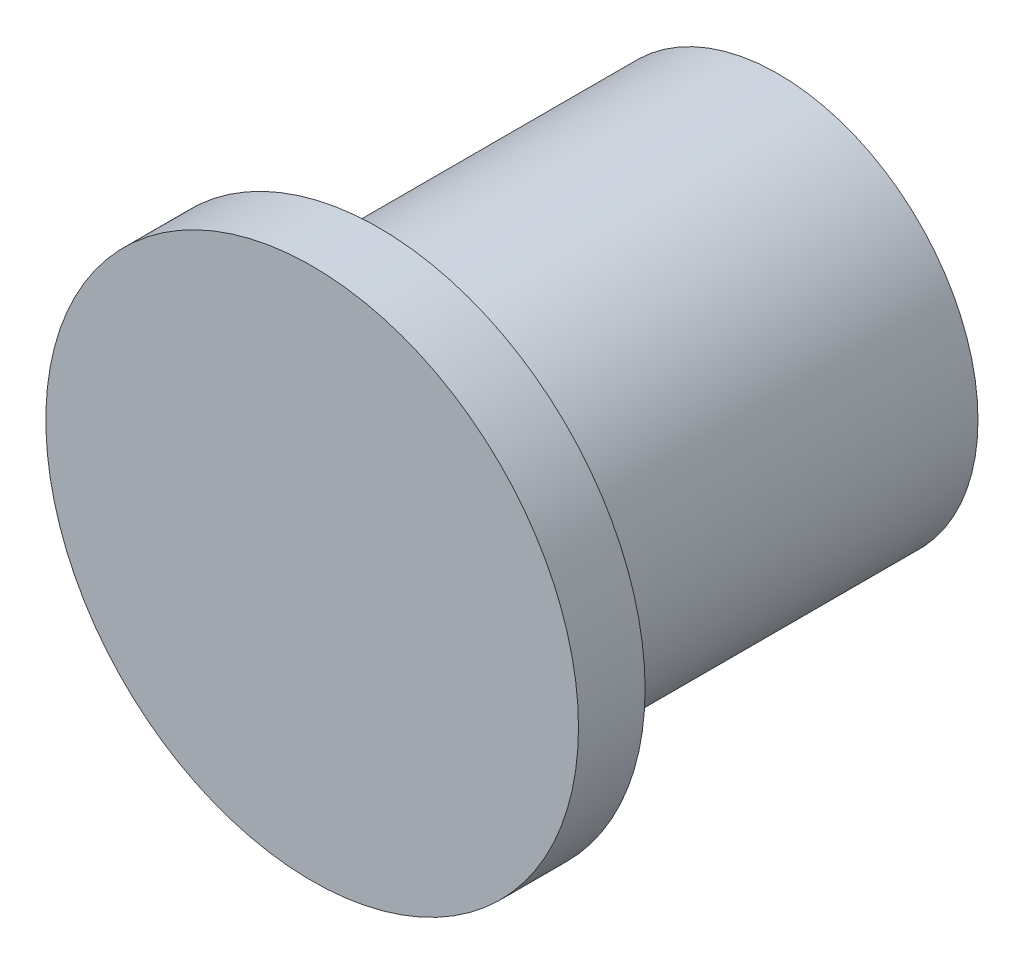
ISO-10303-21;
HEADER;
FILE_DESCRIPTION(('STEP AP214'),'2;1');
FILE_NAME('part.step','',(''),(''),'','','');
FILE_SCHEMA(('AUTOMOTIVE_DESIGN { 1 0 10303 214 1 1 1 1 }'));
ENDSEC;
DATA;
#1=APPLICATION_CONTEXT('core data for automotive mechanical design processes');
#2=APPLICATION_PROTOCOL_DEFINITION('international standard','automotive_design',2000,#1);
#3=PRODUCT_CONTEXT('',#1,'mechanical');
#4=PRODUCT('Part','Part','',(#3));
#5=PRODUCT_RELATED_PRODUCT_CATEGORY('part','',(#4));
#6=PRODUCT_DEFINITION_FORMATION('','',#4);
#7=PRODUCT_DEFINITION_CONTEXT('part definition',#1,'design');
#8=PRODUCT_DEFINITION('design','',#6,#7);
#9=PRODUCT_DEFINITION_SHAPE('','',#8);
#10=(LENGTH_UNIT() NAMED_UNIT(*) SI_UNIT(.MILLI.,.METRE.));
#11=(NAMED_UNIT(*) PLANE_ANGLE_UNIT() SI_UNIT($,.RADIAN.));
#12=(NAMED_UNIT(*) SI_UNIT($,.STERADIAN.) SOLID_ANGLE_UNIT());
#13=UNCERTAINTY_MEASURE_WITH_UNIT(LENGTH_MEASURE(1.E-05),#10,'distance_accuracy_value','');
#14=(GEOMETRIC_REPRESENTATION_CONTEXT(3) GLOBAL_UNCERTAINTY_ASSIGNED_CONTEXT((#13)) GLOBAL_UNIT_ASSIGNED_CONTEXT((#10,
#11,#12)) REPRESENTATION_CONTEXT('',''));
#15=CARTESIAN_POINT('',(0.,0.,0.));
#16=DIRECTION('',(0.,0.,1.));
#17=DIRECTION('',(1.,0.,0.));
#18=AXIS2_PLACEMENT_3D('',#15,#16,#17);
#19=CARTESIAN_POINT('',(0.,0.,152.4));
#20=DIRECTION('',(0.,0.,-1.));
#21=DIRECTION('',(-1.,0.,0.));
#22=AXIS2_PLACEMENT_3D('',#19,#20,#21);
#23=CYLINDRICAL_SURFACE('',#22,76.2);
#24=CARTESIAN_POINT('',(0.,0.,152.4));
#25=DIRECTION('',(0.,0.,1.));
#26=DIRECTION('',(1.,0.,0.));
#27=AXIS2_PLACEMENT_3D('',#24,#25,#26);
#28=CIRCLE('',#27,76.2);
#29=CARTESIAN_POINT('',(76.2,0.,152.4));
#30=VERTEX_POINT('',#29);
#31=EDGE_CURVE('E10',#30,#30,#28,.T.);
#32=ORIENTED_EDGE('',*,*,#31,.F.);
#33=EDGE_LOOP('',(#32));
#34=FACE_BOUND('',#33,.T.);
#35=CARTESIAN_POINT('',(0.,0.,0.));
#36=DIRECTION('',(0.,0.,1.));
#37=DIRECTION('',(1.,0.,0.));
#38=AXIS2_PLACEMENT_3D('',#35,#36,#37);
#39=CIRCLE('',#38,76.2);
#40=CARTESIAN_POINT('',(76.2,0.,0.));
#41=VERTEX_POINT('',#40);
#42=EDGE_CURVE('E44',#41,#41,#39,.T.);
#43=ORIENTED_EDGE('',*,*,#42,.T.);
#44=EDGE_LOOP('',(#43));
#45=FACE_BOUND('',#44,.T.);
#46=ADVANCED_FACE('F41',(#34,#45),#23,.T.);
#47=CARTESIAN_POINT('',(0.,0.,0.));
#48=DIRECTION('',(0.,0.,1.));
#49=DIRECTION('',(1.,0.,0.));
#50=AXIS2_PLACEMENT_3D('',#47,#48,#49);
#51=PLANE('',#50);
#52=ORIENTED_EDGE('',*,*,#42,.F.);
#53=EDGE_LOOP('',(#52));
#54=FACE_BOUND('',#53,.T.);
#55=ADVANCED_FACE('F68',(#54),#51,.F.);
#56=CARTESIAN_POINT('',(0.,0.,177.8));
#57=DIRECTION('',(0.,0.,-1.));
#58=DIRECTION('',(-1.,0.,0.));
#59=AXIS2_PLACEMENT_3D('',#56,#57,#58);
#60=CYLINDRICAL_SURFACE('',#59,101.6);
#61=CARTESIAN_POINT('',(0.,0.,177.8));
#62=DIRECTION('',(0.,0.,1.));
#63=DIRECTION('',(1.,0.,0.));
#64=AXIS2_PLACEMENT_3D('',#61,#62,#63);
#65=CIRCLE('',#64,101.6);
#66=CARTESIAN_POINT('',(101.6,0.,177.8));
#67=VERTEX_POINT('',#66);
#68=EDGE_CURVE('E53',#67,#67,#65,.T.);
#69=ORIENTED_EDGE('',*,*,#68,.F.);
#70=EDGE_LOOP('',(#69));
#71=FACE_BOUND('',#70,.T.);
#72=CARTESIAN_POINT('',(0.,0.,152.4));
#73=DIRECTION('',(0.,0.,1.));
#74=DIRECTION('',(1.,0.,0.));
#75=AXIS2_PLACEMENT_3D('',#72,#73,#74);
#76=CIRCLE('',#75,101.6);
#77=CARTESIAN_POINT('',(101.6,0.,152.4));
#78=VERTEX_POINT('',#77);
#79=EDGE_CURVE('E55',#78,#78,#76,.T.);
#80=ORIENTED_EDGE('',*,*,#79,.T.);
#81=EDGE_LOOP('',(#80));
#82=FACE_BOUND('',#81,.T.);
#83=ADVANCED_FACE('F65',(#71,#82),#60,.T.);
#84=CARTESIAN_POINT('',(0.,0.,177.8));
#85=DIRECTION('',(0.,0.,1.));
#86=DIRECTION('',(1.,0.,0.));
#87=AXIS2_PLACEMENT_3D('',#84,#85,#86);
#88=PLANE('',#87);
#89=ORIENTED_EDGE('',*,*,#68,.T.);
#90=EDGE_LOOP('',(#89));
#91=FACE_BOUND('',#90,.T.);
#92=ADVANCED_FACE('F63',(#91),#88,.T.);
#93=CARTESIAN_POINT('',(0.,0.,152.4));
#94=DIRECTION('',(0.,0.,1.));
#95=DIRECTION('',(1.,0.,0.));
#96=AXIS2_PLACEMENT_3D('',#93,#94,#95);
#97=PLANE('',#96);
#98=ORIENTED_EDGE('',*,*,#31,.T.);
#99=EDGE_LOOP('',(#98));
#100=FACE_BOUND('',#99,.T.);
#101=ORIENTED_EDGE('',*,*,#79,.F.);
#102=EDGE_LOOP('',(#101));
#103=FACE_BOUND('',#102,.T.);
#104=ADVANCED_FACE('F72',(#100,#103),#97,.F.);
#105=CLOSED_SHELL('',(#46,#55,#83,#92,#104));
#106=MANIFOLD_SOLID_BREP('B2',#105);
#107=ADVANCED_BREP_SHAPE_REPRESENTATION('',(#18,#106),#14);
#108=SHAPE_DEFINITION_REPRESENTATION(#9,#107);
ENDSEC;
END-ISO-10303-21;
